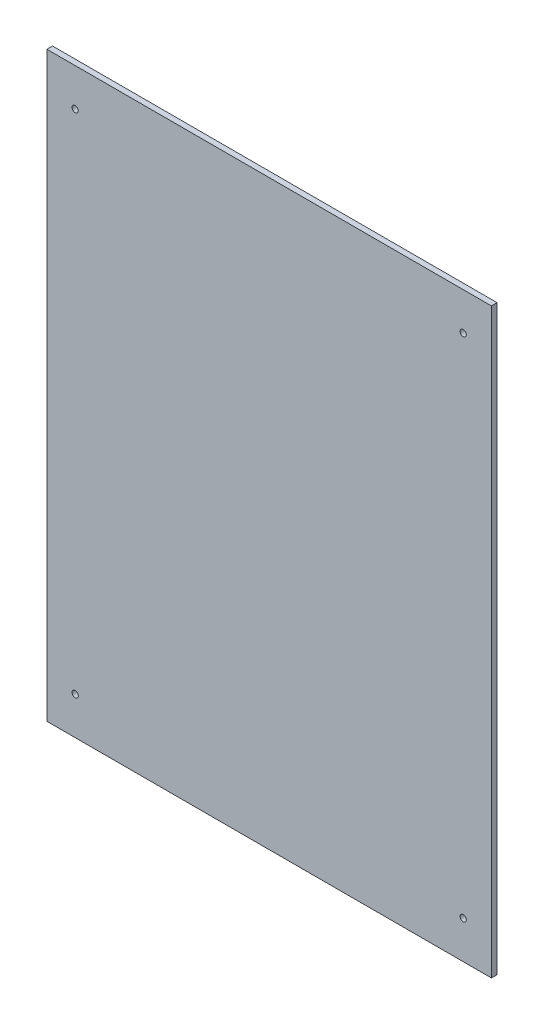
ISO-10303-21;
HEADER;
FILE_DESCRIPTION(('STEP AP214'),'2;1');
FILE_NAME('part.step','',(''),(''),'','','');
FILE_SCHEMA(('AUTOMOTIVE_DESIGN { 1 0 10303 214 1 1 1 1 }'));
ENDSEC;
DATA;
#1=APPLICATION_CONTEXT('core data for automotive mechanical design processes');
#2=APPLICATION_PROTOCOL_DEFINITION('international standard','automotive_design',2000,#1);
#3=PRODUCT_CONTEXT('',#1,'mechanical');
#4=PRODUCT('Part','Part','',(#3));
#5=PRODUCT_RELATED_PRODUCT_CATEGORY('part','',(#4));
#6=PRODUCT_DEFINITION_FORMATION('','',#4);
#7=PRODUCT_DEFINITION_CONTEXT('part definition',#1,'design');
#8=PRODUCT_DEFINITION('design','',#6,#7);
#9=PRODUCT_DEFINITION_SHAPE('','',#8);
#10=(LENGTH_UNIT() NAMED_UNIT(*) SI_UNIT(.MILLI.,.METRE.));
#11=(NAMED_UNIT(*) PLANE_ANGLE_UNIT() SI_UNIT($,.RADIAN.));
#12=(NAMED_UNIT(*) SI_UNIT($,.STERADIAN.) SOLID_ANGLE_UNIT());
#13=UNCERTAINTY_MEASURE_WITH_UNIT(LENGTH_MEASURE(1.E-05),#10,'distance_accuracy_value','');
#14=(GEOMETRIC_REPRESENTATION_CONTEXT(3) GLOBAL_UNCERTAINTY_ASSIGNED_CONTEXT((#13)) GLOBAL_UNIT_ASSIGNED_CONTEXT((#10,
#11,#12)) REPRESENTATION_CONTEXT('',''));
#15=CARTESIAN_POINT('',(0.,0.,0.));
#16=DIRECTION('',(0.,0.,1.));
#17=DIRECTION('',(1.,0.,0.));
#18=AXIS2_PLACEMENT_3D('',#15,#16,#17);
#19=CARTESIAN_POINT('',(0.,0.,3.));
#20=DIRECTION('',(1.,0.,0.));
#21=DIRECTION('',(0.,0.,-1.));
#22=AXIS2_PLACEMENT_3D('',#19,#20,#21);
#23=PLANE('',#22);
#24=DIRECTION('',(0.,-1.,0.));
#25=VECTOR('',#24,1.);
#26=CARTESIAN_POINT('',(0.,0.,0.));
#27=LINE('',#26,#25);
#28=CARTESIAN_POINT('',(0.,309.,0.));
#29=VERTEX_POINT('',#28);
#30=CARTESIAN_POINT('',(0.,0.,0.));
#31=VERTEX_POINT('',#30);
#32=EDGE_CURVE('E97',#29,#31,#27,.T.);
#33=ORIENTED_EDGE('',*,*,#32,.T.);
#34=DIRECTION('',(0.,0.,-1.));
#35=VECTOR('',#34,1.);
#36=CARTESIAN_POINT('',(0.,0.,3.));
#37=LINE('',#36,#35);
#38=CARTESIAN_POINT('',(0.,0.,3.));
#39=VERTEX_POINT('',#38);
#40=EDGE_CURVE('E11',#39,#31,#37,.T.);
#41=ORIENTED_EDGE('',*,*,#40,.F.);
#42=DIRECTION('',(0.,-1.,0.));
#43=VECTOR('',#42,1.);
#44=CARTESIAN_POINT('',(0.,0.,3.));
#45=LINE('',#44,#43);
#46=CARTESIAN_POINT('',(0.,309.,3.));
#47=VERTEX_POINT('',#46);
#48=EDGE_CURVE('E85',#47,#39,#45,.T.);
#49=ORIENTED_EDGE('',*,*,#48,.F.);
#50=DIRECTION('',(0.,0.,-1.));
#51=VECTOR('',#50,1.);
#52=CARTESIAN_POINT('',(0.,309.,3.));
#53=LINE('',#52,#51);
#54=EDGE_CURVE('E93',#47,#29,#53,.T.);
#55=ORIENTED_EDGE('',*,*,#54,.T.);
#56=EDGE_LOOP('',(#33,#41,#49,#55));
#57=FACE_BOUND('',#56,.T.);
#58=ADVANCED_FACE('F34',(#57),#23,.F.);
#59=CARTESIAN_POINT('',(0.,0.,3.));
#60=DIRECTION('',(0.,1.,0.));
#61=DIRECTION('',(0.,0.,1.));
#62=AXIS2_PLACEMENT_3D('',#59,#60,#61);
#63=PLANE('',#62);
#64=DIRECTION('',(1.,0.,0.));
#65=VECTOR('',#64,1.);
#66=CARTESIAN_POINT('',(0.,0.,0.));
#67=LINE('',#66,#65);
#68=CARTESIAN_POINT('',(236.,0.,0.));
#69=VERTEX_POINT('',#68);
#70=EDGE_CURVE('E89',#31,#69,#67,.T.);
#71=ORIENTED_EDGE('',*,*,#70,.T.);
#72=DIRECTION('',(0.,0.,-1.));
#73=VECTOR('',#72,1.);
#74=CARTESIAN_POINT('',(236.,0.,3.));
#75=LINE('',#74,#73);
#76=CARTESIAN_POINT('',(236.,0.,3.));
#77=VERTEX_POINT('',#76);
#78=EDGE_CURVE('E42',#77,#69,#75,.T.);
#79=ORIENTED_EDGE('',*,*,#78,.F.);
#80=DIRECTION('',(1.,0.,0.));
#81=VECTOR('',#80,1.);
#82=CARTESIAN_POINT('',(0.,0.,3.));
#83=LINE('',#82,#81);
#84=EDGE_CURVE('E80',#39,#77,#83,.T.);
#85=ORIENTED_EDGE('',*,*,#84,.F.);
#86=ORIENTED_EDGE('',*,*,#40,.T.);
#87=EDGE_LOOP('',(#71,#79,#85,#86));
#88=FACE_BOUND('',#87,.T.);
#89=ADVANCED_FACE('F88',(#88),#63,.F.);
#90=CARTESIAN_POINT('',(236.,0.,3.));
#91=DIRECTION('',(-1.,0.,0.));
#92=DIRECTION('',(0.,0.,1.));
#93=AXIS2_PLACEMENT_3D('',#90,#91,#92);
#94=PLANE('',#93);
#95=DIRECTION('',(0.,1.,0.));
#96=VECTOR('',#95,1.);
#97=CARTESIAN_POINT('',(236.,0.,0.));
#98=LINE('',#97,#96);
#99=CARTESIAN_POINT('',(236.,309.,0.));
#100=VERTEX_POINT('',#99);
#101=EDGE_CURVE('E67',#69,#100,#98,.T.);
#102=ORIENTED_EDGE('',*,*,#101,.T.);
#103=DIRECTION('',(0.,0.,-1.));
#104=VECTOR('',#103,1.);
#105=CARTESIAN_POINT('',(236.,309.,3.));
#106=LINE('',#105,#104);
#107=CARTESIAN_POINT('',(236.,309.,3.));
#108=VERTEX_POINT('',#107);
#109=EDGE_CURVE('E90',#108,#100,#106,.T.);
#110=ORIENTED_EDGE('',*,*,#109,.F.);
#111=DIRECTION('',(0.,1.,0.));
#112=VECTOR('',#111,1.);
#113=CARTESIAN_POINT('',(236.,0.,3.));
#114=LINE('',#113,#112);
#115=EDGE_CURVE('E83',#77,#108,#114,.T.);
#116=ORIENTED_EDGE('',*,*,#115,.F.);
#117=ORIENTED_EDGE('',*,*,#78,.T.);
#118=EDGE_LOOP('',(#102,#110,#116,#117));
#119=FACE_BOUND('',#118,.T.);
#120=ADVANCED_FACE('F91',(#119),#94,.F.);
#121=CARTESIAN_POINT('',(0.,309.,3.));
#122=DIRECTION('',(0.,-1.,0.));
#123=DIRECTION('',(0.,0.,-1.));
#124=AXIS2_PLACEMENT_3D('',#121,#122,#123);
#125=PLANE('',#124);
#126=DIRECTION('',(-1.,0.,0.));
#127=VECTOR('',#126,1.);
#128=CARTESIAN_POINT('',(0.,309.,0.));
#129=LINE('',#128,#127);
#130=EDGE_CURVE('E73',#100,#29,#129,.T.);
#131=ORIENTED_EDGE('',*,*,#130,.T.);
#132=ORIENTED_EDGE('',*,*,#54,.F.);
#133=DIRECTION('',(-1.,0.,0.));
#134=VECTOR('',#133,1.);
#135=CARTESIAN_POINT('',(0.,309.,3.));
#136=LINE('',#135,#134);
#137=EDGE_CURVE('E50',#108,#47,#136,.T.);
#138=ORIENTED_EDGE('',*,*,#137,.F.);
#139=ORIENTED_EDGE('',*,*,#109,.T.);
#140=EDGE_LOOP('',(#131,#132,#138,#139));
#141=FACE_BOUND('',#140,.T.);
#142=ADVANCED_FACE('F105',(#141),#125,.F.);
#143=CARTESIAN_POINT('',(0.,0.,3.));
#144=DIRECTION('',(0.,0.,-1.));
#145=DIRECTION('',(-1.,0.,0.));
#146=AXIS2_PLACEMENT_3D('',#143,#144,#145);
#147=PLANE('',#146);
#148=CARTESIAN_POINT('',(221.,289.,3.));
#149=DIRECTION('',(0.,0.,1.));
#150=DIRECTION('',(-1.,0.,0.));
#151=AXIS2_PLACEMENT_3D('',#148,#149,#150);
#152=CIRCLE('',#151,1.64999999999999);
#153=CARTESIAN_POINT('',(219.35,289.,3.));
#154=VERTEX_POINT('',#153);
#155=EDGE_CURVE('E117',#154,#154,#152,.T.);
#156=ORIENTED_EDGE('',*,*,#155,.F.);
#157=EDGE_LOOP('',(#156));
#158=FACE_BOUND('',#157,.T.);
#159=CARTESIAN_POINT('',(221.,20.0000000000001,3.));
#160=DIRECTION('',(0.,0.,1.));
#161=DIRECTION('',(1.,0.,0.));
#162=AXIS2_PLACEMENT_3D('',#159,#160,#161);
#163=CIRCLE('',#162,1.64999999999999);
#164=CARTESIAN_POINT('',(222.65,20.0000000000001,3.));
#165=VERTEX_POINT('',#164);
#166=EDGE_CURVE('E123',#165,#165,#163,.T.);
#167=ORIENTED_EDGE('',*,*,#166,.F.);
#168=EDGE_LOOP('',(#167));
#169=FACE_BOUND('',#168,.T.);
#170=CARTESIAN_POINT('',(15.,20.,3.));
#171=DIRECTION('',(0.,0.,1.));
#172=DIRECTION('',(-1.,0.,0.));
#173=AXIS2_PLACEMENT_3D('',#170,#171,#172);
#174=CIRCLE('',#173,1.65000000000001);
#175=CARTESIAN_POINT('',(13.35,20.,3.));
#176=VERTEX_POINT('',#175);
#177=EDGE_CURVE('E129',#176,#176,#174,.T.);
#178=ORIENTED_EDGE('',*,*,#177,.F.);
#179=EDGE_LOOP('',(#178));
#180=FACE_BOUND('',#179,.T.);
#181=CARTESIAN_POINT('',(15.,289.,3.));
#182=DIRECTION('',(0.,0.,1.));
#183=DIRECTION('',(1.,0.,0.));
#184=AXIS2_PLACEMENT_3D('',#181,#182,#183);
#185=CIRCLE('',#184,1.65000000000002);
#186=CARTESIAN_POINT('',(16.65,289.,3.));
#187=VERTEX_POINT('',#186);
#188=EDGE_CURVE('E111',#187,#187,#185,.T.);
#189=ORIENTED_EDGE('',*,*,#188,.F.);
#190=EDGE_LOOP('',(#189));
#191=FACE_BOUND('',#190,.T.);
#192=ORIENTED_EDGE('',*,*,#48,.T.);
#193=ORIENTED_EDGE('',*,*,#84,.T.);
#194=ORIENTED_EDGE('',*,*,#115,.T.);
#195=ORIENTED_EDGE('',*,*,#137,.T.);
#196=EDGE_LOOP('',(#192,#193,#194,#195));
#197=FACE_BOUND('',#196,.T.);
#198=ADVANCED_FACE('F81',(#158,#169,#180,#191,#197),#147,.F.);
#199=CARTESIAN_POINT('',(0.,0.,0.));
#200=DIRECTION('',(0.,0.,-1.));
#201=DIRECTION('',(-1.,0.,0.));
#202=AXIS2_PLACEMENT_3D('',#199,#200,#201);
#203=PLANE('',#202);
#204=CARTESIAN_POINT('',(221.,289.,0.));
#205=DIRECTION('',(0.,0.,1.));
#206=DIRECTION('',(-1.,0.,0.));
#207=AXIS2_PLACEMENT_3D('',#204,#205,#206);
#208=CIRCLE('',#207,1.64999999999999);
#209=CARTESIAN_POINT('',(219.35,289.,0.));
#210=VERTEX_POINT('',#209);
#211=EDGE_CURVE('E120',#210,#210,#208,.T.);
#212=ORIENTED_EDGE('',*,*,#211,.T.);
#213=EDGE_LOOP('',(#212));
#214=FACE_BOUND('',#213,.T.);
#215=CARTESIAN_POINT('',(221.,20.0000000000001,0.));
#216=DIRECTION('',(0.,0.,1.));
#217=DIRECTION('',(1.,0.,0.));
#218=AXIS2_PLACEMENT_3D('',#215,#216,#217);
#219=CIRCLE('',#218,1.64999999999999);
#220=CARTESIAN_POINT('',(222.65,20.0000000000001,0.));
#221=VERTEX_POINT('',#220);
#222=EDGE_CURVE('E126',#221,#221,#219,.T.);
#223=ORIENTED_EDGE('',*,*,#222,.T.);
#224=EDGE_LOOP('',(#223));
#225=FACE_BOUND('',#224,.T.);
#226=CARTESIAN_POINT('',(15.,20.,0.));
#227=DIRECTION('',(0.,0.,1.));
#228=DIRECTION('',(-1.,0.,0.));
#229=AXIS2_PLACEMENT_3D('',#226,#227,#228);
#230=CIRCLE('',#229,1.65000000000001);
#231=CARTESIAN_POINT('',(13.35,20.,0.));
#232=VERTEX_POINT('',#231);
#233=EDGE_CURVE('E114',#232,#232,#230,.T.);
#234=ORIENTED_EDGE('',*,*,#233,.T.);
#235=EDGE_LOOP('',(#234));
#236=FACE_BOUND('',#235,.T.);
#237=CARTESIAN_POINT('',(15.,289.,0.));
#238=DIRECTION('',(0.,0.,1.));
#239=DIRECTION('',(1.,0.,0.));
#240=AXIS2_PLACEMENT_3D('',#237,#238,#239);
#241=CIRCLE('',#240,1.65000000000002);
#242=CARTESIAN_POINT('',(16.65,289.,0.));
#243=VERTEX_POINT('',#242);
#244=EDGE_CURVE('E100',#243,#243,#241,.T.);
#245=ORIENTED_EDGE('',*,*,#244,.T.);
#246=EDGE_LOOP('',(#245));
#247=FACE_BOUND('',#246,.T.);
#248=ORIENTED_EDGE('',*,*,#32,.F.);
#249=ORIENTED_EDGE('',*,*,#130,.F.);
#250=ORIENTED_EDGE('',*,*,#101,.F.);
#251=ORIENTED_EDGE('',*,*,#70,.F.);
#252=EDGE_LOOP('',(#248,#249,#250,#251));
#253=FACE_BOUND('',#252,.T.);
#254=ADVANCED_FACE('F108',(#214,#225,#236,#247,#253),#203,.T.);
#255=CARTESIAN_POINT('',(15.,289.,0.));
#256=DIRECTION('',(0.,0.,1.));
#257=DIRECTION('',(1.,0.,0.));
#258=AXIS2_PLACEMENT_3D('',#255,#256,#257);
#259=CYLINDRICAL_SURFACE('',#258,1.65000000000002);
#260=ORIENTED_EDGE('',*,*,#244,.F.);
#261=EDGE_LOOP('',(#260));
#262=FACE_BOUND('',#261,.T.);
#263=ORIENTED_EDGE('',*,*,#188,.T.);
#264=EDGE_LOOP('',(#263));
#265=FACE_BOUND('',#264,.T.);
#266=ADVANCED_FACE('F141',(#262,#265),#259,.F.);
#267=CARTESIAN_POINT('',(15.,20.,0.));
#268=DIRECTION('',(0.,0.,1.));
#269=DIRECTION('',(1.,0.,0.));
#270=AXIS2_PLACEMENT_3D('',#267,#268,#269);
#271=CYLINDRICAL_SURFACE('',#270,1.65000000000001);
#272=ORIENTED_EDGE('',*,*,#233,.F.);
#273=EDGE_LOOP('',(#272));
#274=FACE_BOUND('',#273,.T.);
#275=ORIENTED_EDGE('',*,*,#177,.T.);
#276=EDGE_LOOP('',(#275));
#277=FACE_BOUND('',#276,.T.);
#278=ADVANCED_FACE('F137',(#274,#277),#271,.F.);
#279=CARTESIAN_POINT('',(221.,20.0000000000001,0.));
#280=DIRECTION('',(0.,0.,1.));
#281=DIRECTION('',(1.,0.,0.));
#282=AXIS2_PLACEMENT_3D('',#279,#280,#281);
#283=CYLINDRICAL_SURFACE('',#282,1.64999999999999);
#284=ORIENTED_EDGE('',*,*,#222,.F.);
#285=EDGE_LOOP('',(#284));
#286=FACE_BOUND('',#285,.T.);
#287=ORIENTED_EDGE('',*,*,#166,.T.);
#288=EDGE_LOOP('',(#287));
#289=FACE_BOUND('',#288,.T.);
#290=ADVANCED_FACE('F140',(#286,#289),#283,.F.);
#291=CARTESIAN_POINT('',(221.,289.,0.));
#292=DIRECTION('',(0.,0.,1.));
#293=DIRECTION('',(1.,0.,0.));
#294=AXIS2_PLACEMENT_3D('',#291,#292,#293);
#295=CYLINDRICAL_SURFACE('',#294,1.64999999999999);
#296=ORIENTED_EDGE('',*,*,#211,.F.);
#297=EDGE_LOOP('',(#296));
#298=FACE_BOUND('',#297,.T.);
#299=ORIENTED_EDGE('',*,*,#155,.T.);
#300=EDGE_LOOP('',(#299));
#301=FACE_BOUND('',#300,.T.);
#302=ADVANCED_FACE('F202',(#298,#301),#295,.F.);
#303=CLOSED_SHELL('',(#58,#89,#120,#142,#198,#254,#266,#278,#290,#302));
#304=MANIFOLD_SOLID_BREP('B2',#303);
#305=ADVANCED_BREP_SHAPE_REPRESENTATION('',(#18,#304),#14);
#306=SHAPE_DEFINITION_REPRESENTATION(#9,#305);
ENDSEC;
END-ISO-10303-21;
